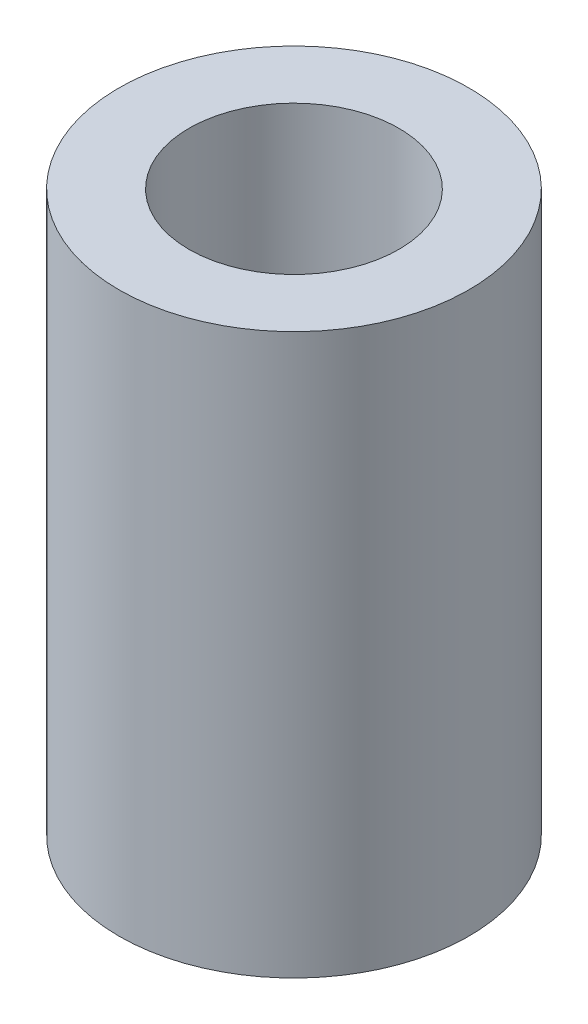
ISO-10303-21;
HEADER;
FILE_DESCRIPTION(('STEP AP214'),'2;1');
FILE_NAME('part.step','',(''),(''),'','','');
FILE_SCHEMA(('AUTOMOTIVE_DESIGN { 1 0 10303 214 1 1 1 1 }'));
ENDSEC;
DATA;
#1=APPLICATION_CONTEXT('core data for automotive mechanical design processes');
#2=APPLICATION_PROTOCOL_DEFINITION('international standard','automotive_design',2000,#1);
#3=PRODUCT_CONTEXT('',#1,'mechanical');
#4=PRODUCT('Part','Part','',(#3));
#5=PRODUCT_RELATED_PRODUCT_CATEGORY('part','',(#4));
#6=PRODUCT_DEFINITION_FORMATION('','',#4);
#7=PRODUCT_DEFINITION_CONTEXT('part definition',#1,'design');
#8=PRODUCT_DEFINITION('design','',#6,#7);
#9=PRODUCT_DEFINITION_SHAPE('','',#8);
#10=(LENGTH_UNIT() NAMED_UNIT(*) SI_UNIT(.MILLI.,.METRE.));
#11=(NAMED_UNIT(*) PLANE_ANGLE_UNIT() SI_UNIT($,.RADIAN.));
#12=(NAMED_UNIT(*) SI_UNIT($,.STERADIAN.) SOLID_ANGLE_UNIT());
#13=UNCERTAINTY_MEASURE_WITH_UNIT(LENGTH_MEASURE(1.E-05),#10,'distance_accuracy_value','');
#14=(GEOMETRIC_REPRESENTATION_CONTEXT(3) GLOBAL_UNCERTAINTY_ASSIGNED_CONTEXT((#13)) GLOBAL_UNIT_ASSIGNED_CONTEXT((#10,
#11,#12)) REPRESENTATION_CONTEXT('',''));
#15=CARTESIAN_POINT('',(0.,0.,0.));
#16=DIRECTION('',(0.,0.,1.));
#17=DIRECTION('',(1.,0.,0.));
#18=AXIS2_PLACEMENT_3D('',#15,#16,#17);
#19=CARTESIAN_POINT('',(0.,8.,0.));
#20=DIRECTION('',(0.,1.,0.));
#21=DIRECTION('',(0.,0.,1.));
#22=AXIS2_PLACEMENT_3D('',#19,#20,#21);
#23=PLANE('',#22);
#24=CARTESIAN_POINT('',(0.,8.,0.));
#25=DIRECTION('',(0.,1.,0.));
#26=DIRECTION('',(0.,0.,1.));
#27=AXIS2_PLACEMENT_3D('',#24,#25,#26);
#28=CIRCLE('',#27,2.5);
#29=CARTESIAN_POINT('',(0.,8.,2.5));
#30=VERTEX_POINT('',#29);
#31=EDGE_CURVE('E10',#30,#30,#28,.T.);
#32=ORIENTED_EDGE('',*,*,#31,.T.);
#33=EDGE_LOOP('',(#32));
#34=FACE_BOUND('',#33,.T.);
#35=CARTESIAN_POINT('',(0.,8.,0.));
#36=DIRECTION('',(0.,1.,0.));
#37=DIRECTION('',(0.,0.,1.));
#38=AXIS2_PLACEMENT_3D('',#35,#36,#37);
#39=CIRCLE('',#38,1.5);
#40=CARTESIAN_POINT('',(0.,8.,1.5));
#41=VERTEX_POINT('',#40);
#42=EDGE_CURVE('E44',#41,#41,#39,.T.);
#43=ORIENTED_EDGE('',*,*,#42,.F.);
#44=EDGE_LOOP('',(#43));
#45=FACE_BOUND('',#44,.T.);
#46=ADVANCED_FACE('F33',(#34,#45),#23,.T.);
#47=CARTESIAN_POINT('',(0.,0.,0.));
#48=DIRECTION('',(0.,1.,0.));
#49=DIRECTION('',(0.,0.,1.));
#50=AXIS2_PLACEMENT_3D('',#47,#48,#49);
#51=PLANE('',#50);
#52=CARTESIAN_POINT('',(0.,0.,0.));
#53=DIRECTION('',(0.,1.,0.));
#54=DIRECTION('',(0.,0.,1.));
#55=AXIS2_PLACEMENT_3D('',#52,#53,#54);
#56=CIRCLE('',#55,2.5);
#57=CARTESIAN_POINT('',(0.,0.,2.5));
#58=VERTEX_POINT('',#57);
#59=EDGE_CURVE('E37',#58,#58,#56,.T.);
#60=ORIENTED_EDGE('',*,*,#59,.F.);
#61=EDGE_LOOP('',(#60));
#62=FACE_BOUND('',#61,.T.);
#63=CARTESIAN_POINT('',(0.,0.,0.));
#64=DIRECTION('',(0.,1.,0.));
#65=DIRECTION('',(0.,0.,1.));
#66=AXIS2_PLACEMENT_3D('',#63,#64,#65);
#67=CIRCLE('',#66,1.5);
#68=CARTESIAN_POINT('',(0.,0.,1.5));
#69=VERTEX_POINT('',#68);
#70=EDGE_CURVE('E46',#69,#69,#67,.T.);
#71=ORIENTED_EDGE('',*,*,#70,.T.);
#72=EDGE_LOOP('',(#71));
#73=FACE_BOUND('',#72,.T.);
#74=ADVANCED_FACE('F56',(#62,#73),#51,.F.);
#75=CARTESIAN_POINT('',(0.,8.,0.));
#76=DIRECTION('',(0.,-1.,0.));
#77=DIRECTION('',(0.,0.,-1.));
#78=AXIS2_PLACEMENT_3D('',#75,#76,#77);
#79=CYLINDRICAL_SURFACE('',#78,2.5);
#80=ORIENTED_EDGE('',*,*,#31,.F.);
#81=EDGE_LOOP('',(#80));
#82=FACE_BOUND('',#81,.T.);
#83=ORIENTED_EDGE('',*,*,#59,.T.);
#84=EDGE_LOOP('',(#83));
#85=FACE_BOUND('',#84,.T.);
#86=ADVANCED_FACE('F35',(#82,#85),#79,.T.);
#87=CARTESIAN_POINT('',(0.,8.,0.));
#88=DIRECTION('',(0.,-1.,0.));
#89=DIRECTION('',(0.,0.,-1.));
#90=AXIS2_PLACEMENT_3D('',#87,#88,#89);
#91=CYLINDRICAL_SURFACE('',#90,1.5);
#92=ORIENTED_EDGE('',*,*,#42,.T.);
#93=EDGE_LOOP('',(#92));
#94=FACE_BOUND('',#93,.T.);
#95=ORIENTED_EDGE('',*,*,#70,.F.);
#96=EDGE_LOOP('',(#95));
#97=FACE_BOUND('',#96,.T.);
#98=ADVANCED_FACE('F52',(#94,#97),#91,.F.);
#99=CLOSED_SHELL('',(#46,#74,#86,#98));
#100=MANIFOLD_SOLID_BREP('B2',#99);
#101=ADVANCED_BREP_SHAPE_REPRESENTATION('',(#18,#100),#14);
#102=SHAPE_DEFINITION_REPRESENTATION(#9,#101);
ENDSEC;
END-ISO-10303-21;
